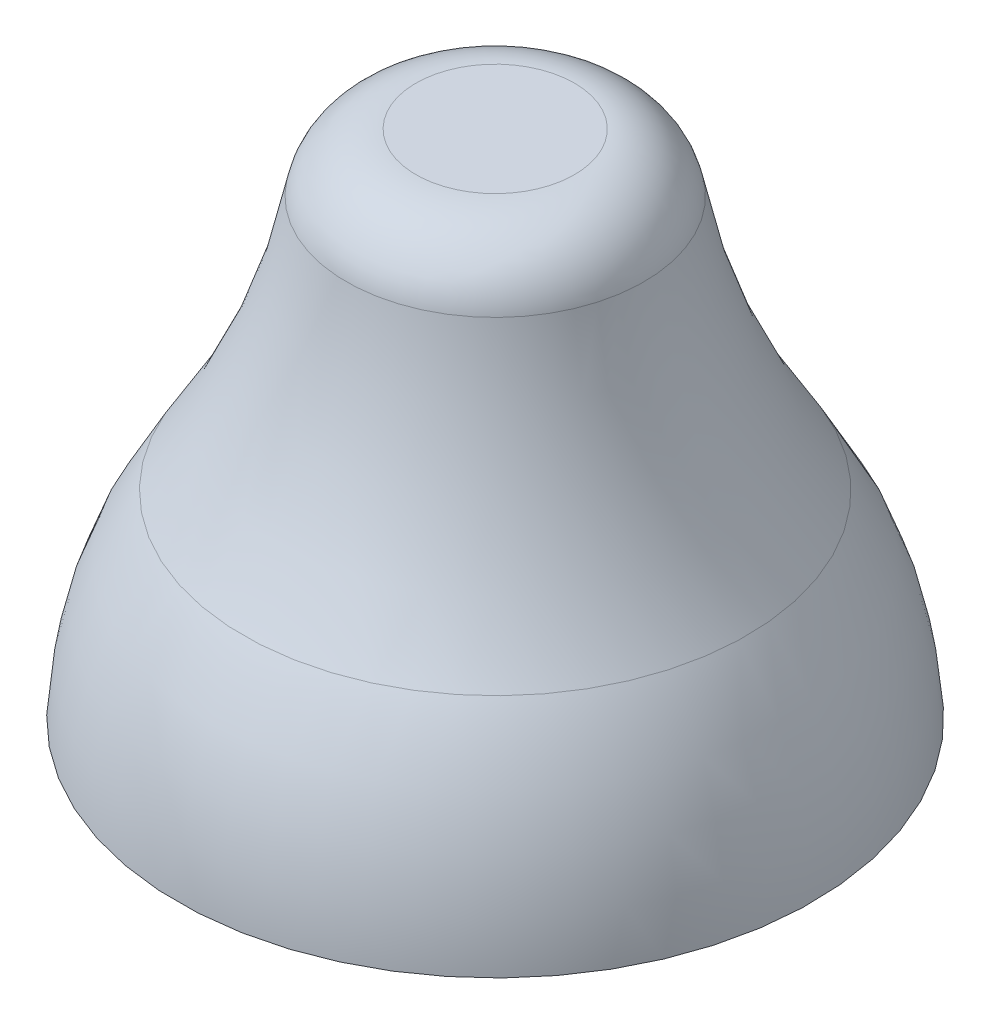
ISO-10303-21;
HEADER;
FILE_DESCRIPTION(('STEP AP214'),'2;1');
FILE_NAME('part.step','',(''),(''),'','','');
FILE_SCHEMA(('AUTOMOTIVE_DESIGN { 1 0 10303 214 1 1 1 1 }'));
ENDSEC;
DATA;
#1=APPLICATION_CONTEXT('core data for automotive mechanical design processes');
#2=APPLICATION_PROTOCOL_DEFINITION('international standard','automotive_design',2000,#1);
#3=PRODUCT_CONTEXT('',#1,'mechanical');
#4=PRODUCT('Part','Part','',(#3));
#5=PRODUCT_RELATED_PRODUCT_CATEGORY('part','',(#4));
#6=PRODUCT_DEFINITION_FORMATION('','',#4);
#7=PRODUCT_DEFINITION_CONTEXT('part definition',#1,'design');
#8=PRODUCT_DEFINITION('design','',#6,#7);
#9=PRODUCT_DEFINITION_SHAPE('','',#8);
#10=(LENGTH_UNIT() NAMED_UNIT(*) SI_UNIT(.MILLI.,.METRE.));
#11=(NAMED_UNIT(*) PLANE_ANGLE_UNIT() SI_UNIT($,.RADIAN.));
#12=(NAMED_UNIT(*) SI_UNIT($,.STERADIAN.) SOLID_ANGLE_UNIT());
#13=UNCERTAINTY_MEASURE_WITH_UNIT(LENGTH_MEASURE(1.E-05),#10,'distance_accuracy_value','');
#14=(GEOMETRIC_REPRESENTATION_CONTEXT(3) GLOBAL_UNCERTAINTY_ASSIGNED_CONTEXT((#13)) GLOBAL_UNIT_ASSIGNED_CONTEXT((#10,
#11,#12)) REPRESENTATION_CONTEXT('',''));
#15=CARTESIAN_POINT('',(0.,0.,0.));
#16=DIRECTION('',(0.,0.,1.));
#17=DIRECTION('',(1.,0.,0.));
#18=AXIS2_PLACEMENT_3D('',#15,#16,#17);
#19=CARTESIAN_POINT('',(0.,0.,0.));
#20=DIRECTION('',(0.,-1.,0.));
#21=DIRECTION('',(0.,0.,-1.));
#22=AXIS2_PLACEMENT_3D('',#19,#20,#21);
#23=PLANE('',#22);
#24=CARTESIAN_POINT('',(0.,0.,0.));
#25=DIRECTION('',(0.,-1.,0.));
#26=DIRECTION('',(0.,0.,-1.));
#27=AXIS2_PLACEMENT_3D('',#24,#25,#26);
#28=CIRCLE('',#27,0.9);
#29=CARTESIAN_POINT('',(0.,0.,-0.9));
#30=VERTEX_POINT('',#29);
#31=EDGE_CURVE('E10',#30,#30,#28,.T.);
#32=ORIENTED_EDGE('',*,*,#31,.T.);
#33=EDGE_LOOP('',(#32));
#34=FACE_BOUND('',#33,.T.);
#35=ADVANCED_FACE('F31',(#34),#23,.T.);
#36=CARTESIAN_POINT('',(0.,-0.0518725651329564,0.));
#37=DIRECTION('',(0.,-1.,0.));
#38=DIRECTION('',(0.,0.,-1.));
#39=AXIS2_PLACEMENT_3D('',#36,#37,#38);
#40=DEGENERATE_TOROIDAL_SURFACE('',#39,0.198776245186674,1.1,.F.);
#41=CARTESIAN_POINT('',(0.,0.562,0.));
#42=DIRECTION('',(0.,-1.,0.));
#43=DIRECTION('',(0.,0.,-1.));
#44=AXIS2_PLACEMENT_3D('',#41,#42,#43);
#45=CIRCLE('',#44,0.714);
#46=CARTESIAN_POINT('',(0.,0.562,-0.714));
#47=VERTEX_POINT('',#46);
#48=EDGE_CURVE('E37',#47,#47,#45,.T.);
#49=ORIENTED_EDGE('',*,*,#48,.T.);
#50=EDGE_LOOP('',(#49));
#51=FACE_BOUND('',#50,.T.);
#52=ORIENTED_EDGE('',*,*,#31,.F.);
#53=EDGE_LOOP('',(#52));
#54=FACE_BOUND('',#53,.T.);
#55=ADVANCED_FACE('F63',(#51,#54),#40,.F.);
#56=CARTESIAN_POINT('',(0.,1.62005549957691,0.));
#57=DIRECTION('',(0.,-1.,0.));
#58=DIRECTION('',(0.,0.,-1.));
#59=AXIS2_PLACEMENT_3D('',#56,#57,#58);
#60=TOROIDAL_SURFACE('',#59,2.29213768721714,1.9);
#61=CARTESIAN_POINT('',(0.,1.285,0.));
#62=DIRECTION('',(0.,-1.,0.));
#63=DIRECTION('',(0.,0.,-1.));
#64=AXIS2_PLACEMENT_3D('',#61,#62,#63);
#65=CIRCLE('',#64,0.421913686675152);
#66=CARTESIAN_POINT('',(0.,1.285,-0.421913686675152));
#67=VERTEX_POINT('',#66);
#68=EDGE_CURVE('E41',#67,#67,#65,.T.);
#69=ORIENTED_EDGE('',*,*,#68,.T.);
#70=EDGE_LOOP('',(#69));
#71=FACE_BOUND('',#70,.T.);
#72=ORIENTED_EDGE('',*,*,#48,.F.);
#73=EDGE_LOOP('',(#72));
#74=FACE_BOUND('',#73,.T.);
#75=ADVANCED_FACE('F60',(#71,#74),#60,.F.);
#76=CARTESIAN_POINT('',(0.,1.25,0.));
#77=DIRECTION('',(0.,-1.,0.));
#78=DIRECTION('',(0.,0.,-1.));
#79=AXIS2_PLACEMENT_3D('',#76,#77,#78);
#80=TOROIDAL_SURFACE('',#79,0.225,0.2);
#81=CARTESIAN_POINT('',(0.,1.45,0.));
#82=DIRECTION('',(0.,-1.,0.));
#83=DIRECTION('',(0.,0.,-1.));
#84=AXIS2_PLACEMENT_3D('',#81,#82,#83);
#85=CIRCLE('',#84,0.225);
#86=CARTESIAN_POINT('',(0.,1.45,-0.225));
#87=VERTEX_POINT('',#86);
#88=EDGE_CURVE('E45',#87,#87,#85,.T.);
#89=ORIENTED_EDGE('',*,*,#88,.T.);
#90=EDGE_LOOP('',(#89));
#91=FACE_BOUND('',#90,.T.);
#92=ORIENTED_EDGE('',*,*,#68,.F.);
#93=EDGE_LOOP('',(#92));
#94=FACE_BOUND('',#93,.T.);
#95=ADVANCED_FACE('F51',(#91,#94),#80,.T.);
#96=CARTESIAN_POINT('',(0.,1.45,0.));
#97=DIRECTION('',(0.,1.,0.));
#98=DIRECTION('',(0.,0.,1.));
#99=AXIS2_PLACEMENT_3D('',#96,#97,#98);
#100=PLANE('',#99);
#101=ORIENTED_EDGE('',*,*,#88,.F.);
#102=EDGE_LOOP('',(#101));
#103=FACE_BOUND('',#102,.T.);
#104=ADVANCED_FACE('F54',(#103),#100,.T.);
#105=CLOSED_SHELL('',(#35,#55,#75,#95,#104));
#106=MANIFOLD_SOLID_BREP('B2',#105);
#107=ADVANCED_BREP_SHAPE_REPRESENTATION('',(#18,#106),#14);
#108=SHAPE_DEFINITION_REPRESENTATION(#9,#107);
ENDSEC;
END-ISO-10303-21;
